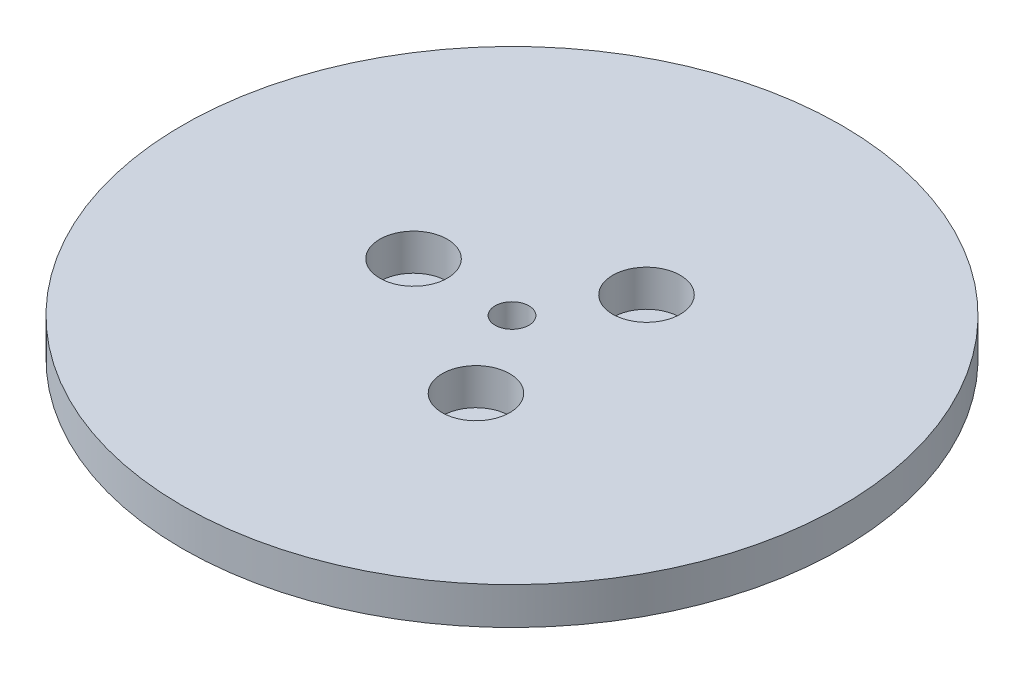
ISO-10303-21;
HEADER;
FILE_DESCRIPTION(('STEP AP214'),'2;1');
FILE_NAME('part.step','',(''),(''),'','','');
FILE_SCHEMA(('AUTOMOTIVE_DESIGN { 1 0 10303 214 1 1 1 1 }'));
ENDSEC;
DATA;
#1=APPLICATION_CONTEXT('core data for automotive mechanical design processes');
#2=APPLICATION_PROTOCOL_DEFINITION('international standard','automotive_design',2000,#1);
#3=PRODUCT_CONTEXT('',#1,'mechanical');
#4=PRODUCT('Part','Part','',(#3));
#5=PRODUCT_RELATED_PRODUCT_CATEGORY('part','',(#4));
#6=PRODUCT_DEFINITION_FORMATION('','',#4);
#7=PRODUCT_DEFINITION_CONTEXT('part definition',#1,'design');
#8=PRODUCT_DEFINITION('design','',#6,#7);
#9=PRODUCT_DEFINITION_SHAPE('','',#8);
#10=(LENGTH_UNIT() NAMED_UNIT(*) SI_UNIT(.MILLI.,.METRE.));
#11=(NAMED_UNIT(*) PLANE_ANGLE_UNIT() SI_UNIT($,.RADIAN.));
#12=(NAMED_UNIT(*) SI_UNIT($,.STERADIAN.) SOLID_ANGLE_UNIT());
#13=UNCERTAINTY_MEASURE_WITH_UNIT(LENGTH_MEASURE(1.E-05),#10,'distance_accuracy_value','');
#14=(GEOMETRIC_REPRESENTATION_CONTEXT(3) GLOBAL_UNCERTAINTY_ASSIGNED_CONTEXT((#13)) GLOBAL_UNIT_ASSIGNED_CONTEXT((#10,
#11,#12)) REPRESENTATION_CONTEXT('',''));
#15=CARTESIAN_POINT('',(0.,0.,0.));
#16=DIRECTION('',(0.,0.,1.));
#17=DIRECTION('',(1.,0.,0.));
#18=AXIS2_PLACEMENT_3D('',#15,#16,#17);
#19=CARTESIAN_POINT('',(0.,11.,0.));
#20=DIRECTION('',(0.,-1.,0.));
#21=DIRECTION('',(0.,0.,-1.));
#22=AXIS2_PLACEMENT_3D('',#19,#20,#21);
#23=CYLINDRICAL_SURFACE('',#22,97.5);
#24=CARTESIAN_POINT('',(0.,11.,0.));
#25=DIRECTION('',(0.,1.,0.));
#26=DIRECTION('',(0.,0.,1.));
#27=AXIS2_PLACEMENT_3D('',#24,#25,#26);
#28=CIRCLE('',#27,97.5);
#29=CARTESIAN_POINT('',(0.,11.,97.5));
#30=VERTEX_POINT('',#29);
#31=EDGE_CURVE('E10',#30,#30,#28,.T.);
#32=ORIENTED_EDGE('',*,*,#31,.F.);
#33=EDGE_LOOP('',(#32));
#34=FACE_BOUND('',#33,.T.);
#35=CARTESIAN_POINT('',(0.,0.,0.));
#36=DIRECTION('',(0.,1.,0.));
#37=DIRECTION('',(0.,0.,1.));
#38=AXIS2_PLACEMENT_3D('',#35,#36,#37);
#39=CIRCLE('',#38,97.5);
#40=CARTESIAN_POINT('',(0.,0.,97.5));
#41=VERTEX_POINT('',#40);
#42=EDGE_CURVE('E37',#41,#41,#39,.T.);
#43=ORIENTED_EDGE('',*,*,#42,.T.);
#44=EDGE_LOOP('',(#43));
#45=FACE_BOUND('',#44,.T.);
#46=ADVANCED_FACE('F40',(#34,#45),#23,.T.);
#47=CARTESIAN_POINT('',(0.,11.,0.));
#48=DIRECTION('',(0.,1.,0.));
#49=DIRECTION('',(0.,0.,1.));
#50=AXIS2_PLACEMENT_3D('',#47,#48,#49);
#51=PLANE('',#50);
#52=CARTESIAN_POINT('',(14.5640577916823,11.,25.2256880595629));
#53=DIRECTION('',(0.,1.,0.));
#54=DIRECTION('',(0.866025403784436,0.,-0.500000000000004));
#55=AXIS2_PLACEMENT_3D('',#52,#53,#54);
#56=CIRCLE('',#55,10.);
#57=CARTESIAN_POINT('',(23.2243118295267,11.,20.2256880595628));
#58=VERTEX_POINT('',#57);
#59=EDGE_CURVE('E70',#58,#58,#56,.T.);
#60=ORIENTED_EDGE('',*,*,#59,.F.);
#61=EDGE_LOOP('',(#60));
#62=FACE_BOUND('',#61,.T.);
#63=CARTESIAN_POINT('',(14.564057791682,11.,-25.2256880595631));
#64=DIRECTION('',(0.,1.,0.));
#65=DIRECTION('',(-0.866025403784443,0.,-0.499999999999992));
#66=AXIS2_PLACEMENT_3D('',#63,#64,#65);
#67=CIRCLE('',#66,10.);
#68=CARTESIAN_POINT('',(5.90380375383752,11.,-30.225688059563));
#69=VERTEX_POINT('',#68);
#70=EDGE_CURVE('E61',#69,#69,#67,.T.);
#71=ORIENTED_EDGE('',*,*,#70,.F.);
#72=EDGE_LOOP('',(#71));
#73=FACE_BOUND('',#72,.T.);
#74=CARTESIAN_POINT('',(-29.1281155833644,11.,0.));
#75=DIRECTION('',(0.,1.,0.));
#76=DIRECTION('',(0.,0.,1.));
#77=AXIS2_PLACEMENT_3D('',#74,#75,#76);
#78=CIRCLE('',#77,10.);
#79=CARTESIAN_POINT('',(-29.1281155833644,11.,10.));
#80=VERTEX_POINT('',#79);
#81=EDGE_CURVE('E54',#80,#80,#78,.T.);
#82=ORIENTED_EDGE('',*,*,#81,.F.);
#83=EDGE_LOOP('',(#82));
#84=FACE_BOUND('',#83,.T.);
#85=CARTESIAN_POINT('',(0.,11.,0.));
#86=DIRECTION('',(0.,1.,0.));
#87=DIRECTION('',(0.,0.,1.));
#88=AXIS2_PLACEMENT_3D('',#85,#86,#87);
#89=CIRCLE('',#88,5.);
#90=CARTESIAN_POINT('',(0.,11.,5.));
#91=VERTEX_POINT('',#90);
#92=EDGE_CURVE('E50',#91,#91,#89,.T.);
#93=ORIENTED_EDGE('',*,*,#92,.F.);
#94=EDGE_LOOP('',(#93));
#95=FACE_BOUND('',#94,.T.);
#96=ORIENTED_EDGE('',*,*,#31,.T.);
#97=EDGE_LOOP('',(#96));
#98=FACE_BOUND('',#97,.T.);
#99=ADVANCED_FACE('F85',(#62,#73,#84,#95,#98),#51,.T.);
#100=CARTESIAN_POINT('',(0.,0.,0.));
#101=DIRECTION('',(0.,1.,0.));
#102=DIRECTION('',(0.,0.,1.));
#103=AXIS2_PLACEMENT_3D('',#100,#101,#102);
#104=PLANE('',#103);
#105=CARTESIAN_POINT('',(0.,0.,0.));
#106=DIRECTION('',(0.,1.,0.));
#107=DIRECTION('',(0.,0.,1.));
#108=AXIS2_PLACEMENT_3D('',#105,#106,#107);
#109=CIRCLE('',#108,5.);
#110=CARTESIAN_POINT('',(0.,0.,5.));
#111=VERTEX_POINT('',#110);
#112=EDGE_CURVE('E47',#111,#111,#109,.T.);
#113=ORIENTED_EDGE('',*,*,#112,.T.);
#114=EDGE_LOOP('',(#113));
#115=FACE_BOUND('',#114,.T.);
#116=ORIENTED_EDGE('',*,*,#42,.F.);
#117=EDGE_LOOP('',(#116));
#118=FACE_BOUND('',#117,.T.);
#119=ADVANCED_FACE('F84',(#115,#118),#104,.F.);
#120=CARTESIAN_POINT('',(0.,11.,0.));
#121=DIRECTION('',(0.,-1.,0.));
#122=DIRECTION('',(0.,0.,-1.));
#123=AXIS2_PLACEMENT_3D('',#120,#121,#122);
#124=CYLINDRICAL_SURFACE('',#123,5.);
#125=ORIENTED_EDGE('',*,*,#92,.T.);
#126=EDGE_LOOP('',(#125));
#127=FACE_BOUND('',#126,.T.);
#128=ORIENTED_EDGE('',*,*,#112,.F.);
#129=EDGE_LOOP('',(#128));
#130=FACE_BOUND('',#129,.T.);
#131=ADVANCED_FACE('F91',(#127,#130),#124,.F.);
#132=CARTESIAN_POINT('',(-29.1281155833644,0.209880048849025,0.));
#133=DIRECTION('',(0.,1.,0.));
#134=DIRECTION('',(0.,0.,1.));
#135=AXIS2_PLACEMENT_3D('',#132,#133,#134);
#136=CYLINDRICAL_SURFACE('',#135,10.);
#137=CARTESIAN_POINT('',(-29.1281155833644,0.209880048849025,0.));
#138=DIRECTION('',(0.,1.,0.));
#139=DIRECTION('',(0.,0.,1.));
#140=AXIS2_PLACEMENT_3D('',#137,#138,#139);
#141=CIRCLE('',#140,10.);
#142=CARTESIAN_POINT('',(-29.1281155833644,0.209880048849025,10.));
#143=VERTEX_POINT('',#142);
#144=EDGE_CURVE('E55',#143,#143,#141,.T.);
#145=ORIENTED_EDGE('',*,*,#144,.F.);
#146=EDGE_LOOP('',(#145));
#147=FACE_BOUND('',#146,.T.);
#148=ORIENTED_EDGE('',*,*,#81,.T.);
#149=EDGE_LOOP('',(#148));
#150=FACE_BOUND('',#149,.T.);
#151=ADVANCED_FACE('F96',(#147,#150),#136,.F.);
#152=CARTESIAN_POINT('',(-29.1281155833644,0.209880048849025,0.));
#153=DIRECTION('',(0.,1.,0.));
#154=DIRECTION('',(0.,0.,1.));
#155=AXIS2_PLACEMENT_3D('',#152,#153,#154);
#156=PLANE('',#155);
#157=ORIENTED_EDGE('',*,*,#144,.T.);
#158=EDGE_LOOP('',(#157));
#159=FACE_BOUND('',#158,.T.);
#160=ADVANCED_FACE('F127',(#159),#156,.T.);
#161=CARTESIAN_POINT('',(14.564057791682,0.209880048849025,-25.2256880595631));
#162=DIRECTION('',(0.,1.,0.));
#163=DIRECTION('',(0.,0.,1.));
#164=AXIS2_PLACEMENT_3D('',#161,#162,#163);
#165=CYLINDRICAL_SURFACE('',#164,10.);
#166=CARTESIAN_POINT('',(14.564057791682,0.209880048849025,-25.2256880595631));
#167=DIRECTION('',(0.,1.,0.));
#168=DIRECTION('',(-0.866025403784443,0.,-0.499999999999992));
#169=AXIS2_PLACEMENT_3D('',#166,#167,#168);
#170=CIRCLE('',#169,10.);
#171=CARTESIAN_POINT('',(5.90380375383752,0.209880048849025,-30.225688059563));
#172=VERTEX_POINT('',#171);
#173=EDGE_CURVE('E63',#172,#172,#170,.T.);
#174=ORIENTED_EDGE('',*,*,#173,.F.);
#175=EDGE_LOOP('',(#174));
#176=FACE_BOUND('',#175,.T.);
#177=ORIENTED_EDGE('',*,*,#70,.T.);
#178=EDGE_LOOP('',(#177));
#179=FACE_BOUND('',#178,.T.);
#180=ADVANCED_FACE('F133',(#176,#179),#165,.F.);
#181=CARTESIAN_POINT('',(14.564057791682,0.209880048849025,-25.2256880595631));
#182=DIRECTION('',(0.,1.,0.));
#183=DIRECTION('',(-0.866025403784443,0.,-0.499999999999992));
#184=AXIS2_PLACEMENT_3D('',#181,#182,#183);
#185=PLANE('',#184);
#186=ORIENTED_EDGE('',*,*,#173,.T.);
#187=EDGE_LOOP('',(#186));
#188=FACE_BOUND('',#187,.T.);
#189=ADVANCED_FACE('F77',(#188),#185,.T.);
#190=CARTESIAN_POINT('',(14.5640577916823,0.209880048849025,25.2256880595629));
#191=DIRECTION('',(0.,1.,0.));
#192=DIRECTION('',(0.,0.,1.));
#193=AXIS2_PLACEMENT_3D('',#190,#191,#192);
#194=CYLINDRICAL_SURFACE('',#193,10.);
#195=CARTESIAN_POINT('',(14.5640577916823,0.209880048849025,25.2256880595629));
#196=DIRECTION('',(0.,1.,0.));
#197=DIRECTION('',(0.866025403784436,0.,-0.500000000000004));
#198=AXIS2_PLACEMENT_3D('',#195,#196,#197);
#199=CIRCLE('',#198,10.);
#200=CARTESIAN_POINT('',(23.2243118295267,0.209880048849025,20.2256880595628));
#201=VERTEX_POINT('',#200);
#202=EDGE_CURVE('E59',#201,#201,#199,.T.);
#203=ORIENTED_EDGE('',*,*,#202,.F.);
#204=EDGE_LOOP('',(#203));
#205=FACE_BOUND('',#204,.T.);
#206=ORIENTED_EDGE('',*,*,#59,.T.);
#207=EDGE_LOOP('',(#206));
#208=FACE_BOUND('',#207,.T.);
#209=ADVANCED_FACE('F73',(#205,#208),#194,.F.);
#210=CARTESIAN_POINT('',(14.5640577916823,0.209880048849025,25.2256880595629));
#211=DIRECTION('',(0.,1.,0.));
#212=DIRECTION('',(0.866025403784436,0.,-0.500000000000004));
#213=AXIS2_PLACEMENT_3D('',#210,#211,#212);
#214=PLANE('',#213);
#215=ORIENTED_EDGE('',*,*,#202,.T.);
#216=EDGE_LOOP('',(#215));
#217=FACE_BOUND('',#216,.T.);
#218=ADVANCED_FACE('F71',(#217),#214,.T.);
#219=CLOSED_SHELL('',(#46,#99,#119,#131,#151,#160,#180,#189,#209,#218));
#220=MANIFOLD_SOLID_BREP('B2',#219);
#221=ADVANCED_BREP_SHAPE_REPRESENTATION('',(#18,#220),#14);
#222=SHAPE_DEFINITION_REPRESENTATION(#9,#221);
ENDSEC;
END-ISO-10303-21;
